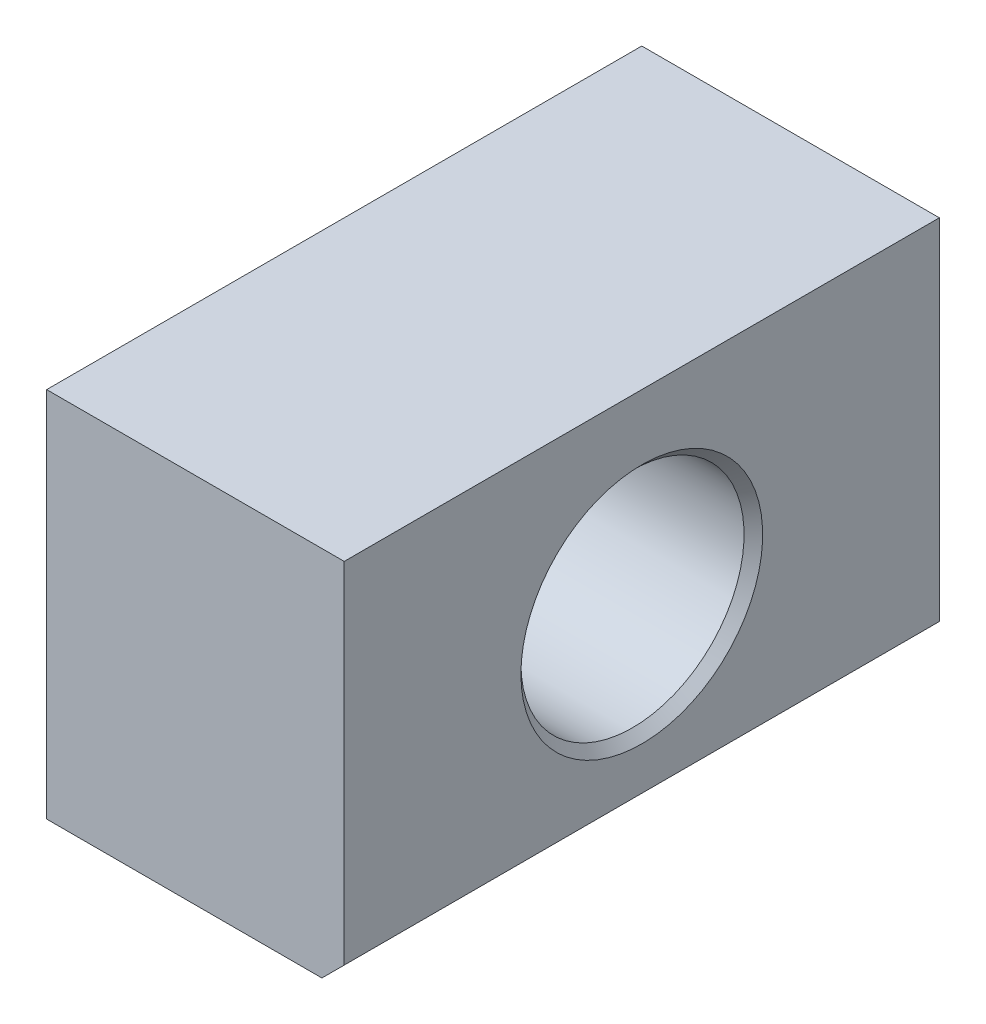
ISO-10303-21;
HEADER;
FILE_DESCRIPTION(('STEP AP214'),'2;1');
FILE_NAME('part.step','',(''),(''),'','','');
FILE_SCHEMA(('AUTOMOTIVE_DESIGN { 1 0 10303 214 1 1 1 1 }'));
ENDSEC;
DATA;
#1=APPLICATION_CONTEXT('core data for automotive mechanical design processes');
#2=APPLICATION_PROTOCOL_DEFINITION('international standard','automotive_design',2000,#1);
#3=PRODUCT_CONTEXT('',#1,'mechanical');
#4=PRODUCT('Part','Part','',(#3));
#5=PRODUCT_RELATED_PRODUCT_CATEGORY('part','',(#4));
#6=PRODUCT_DEFINITION_FORMATION('','',#4);
#7=PRODUCT_DEFINITION_CONTEXT('part definition',#1,'design');
#8=PRODUCT_DEFINITION('design','',#6,#7);
#9=PRODUCT_DEFINITION_SHAPE('','',#8);
#10=(LENGTH_UNIT() NAMED_UNIT(*) SI_UNIT(.MILLI.,.METRE.));
#11=(NAMED_UNIT(*) PLANE_ANGLE_UNIT() SI_UNIT($,.RADIAN.));
#12=(NAMED_UNIT(*) SI_UNIT($,.STERADIAN.) SOLID_ANGLE_UNIT());
#13=UNCERTAINTY_MEASURE_WITH_UNIT(LENGTH_MEASURE(1.E-05),#10,'distance_accuracy_value','');
#14=(GEOMETRIC_REPRESENTATION_CONTEXT(3) GLOBAL_UNCERTAINTY_ASSIGNED_CONTEXT((#13)) GLOBAL_UNIT_ASSIGNED_CONTEXT((#10,
#11,#12)) REPRESENTATION_CONTEXT('',''));
#15=CARTESIAN_POINT('',(0.,0.,0.));
#16=DIRECTION('',(0.,0.,1.));
#17=DIRECTION('',(1.,0.,0.));
#18=AXIS2_PLACEMENT_3D('',#15,#16,#17);
#19=CARTESIAN_POINT('',(-2.,-2.5,8.));
#20=DIRECTION('',(1.,0.,0.));
#21=DIRECTION('',(0.,0.,-1.));
#22=AXIS2_PLACEMENT_3D('',#19,#20,#21);
#23=PLANE('',#22);
#24=CARTESIAN_POINT('',(-2.,0.,4.));
#25=DIRECTION('',(-1.,0.,0.));
#26=DIRECTION('',(0.,0.,1.));
#27=AXIS2_PLACEMENT_3D('',#24,#25,#26);
#28=CIRCLE('',#27,1.625);
#29=CARTESIAN_POINT('',(-2.,0.,5.625));
#30=VERTEX_POINT('',#29);
#31=EDGE_CURVE('E121',#30,#30,#28,.T.);
#32=ORIENTED_EDGE('',*,*,#31,.F.);
#33=EDGE_LOOP('',(#32));
#34=FACE_BOUND('',#33,.T.);
#35=DIRECTION('',(0.,-1.,0.));
#36=VECTOR('',#35,1.);
#37=CARTESIAN_POINT('',(-2.,-2.5,0.));
#38=LINE('',#37,#36);
#39=CARTESIAN_POINT('',(-2.,2.5,0.));
#40=VERTEX_POINT('',#39);
#41=CARTESIAN_POINT('',(-2.,-2.5,0.));
#42=VERTEX_POINT('',#41);
#43=EDGE_CURVE('E95',#40,#42,#38,.T.);
#44=ORIENTED_EDGE('',*,*,#43,.T.);
#45=DIRECTION('',(0.,0.,-1.));
#46=VECTOR('',#45,1.);
#47=CARTESIAN_POINT('',(-2.,-2.5,8.));
#48=LINE('',#47,#46);
#49=CARTESIAN_POINT('',(-2.,-2.5,8.));
#50=VERTEX_POINT('',#49);
#51=EDGE_CURVE('E78',#50,#42,#48,.T.);
#52=ORIENTED_EDGE('',*,*,#51,.F.);
#53=DIRECTION('',(0.,-1.,0.));
#54=VECTOR('',#53,1.);
#55=CARTESIAN_POINT('',(-2.,-2.5,8.));
#56=LINE('',#55,#54);
#57=CARTESIAN_POINT('',(-2.,2.5,8.));
#58=VERTEX_POINT('',#57);
#59=EDGE_CURVE('E83',#58,#50,#56,.T.);
#60=ORIENTED_EDGE('',*,*,#59,.F.);
#61=DIRECTION('',(0.,0.,-1.));
#62=VECTOR('',#61,1.);
#63=CARTESIAN_POINT('',(-2.,2.5,8.));
#64=LINE('',#63,#62);
#65=EDGE_CURVE('E102',#58,#40,#64,.T.);
#66=ORIENTED_EDGE('',*,*,#65,.T.);
#67=EDGE_LOOP('',(#44,#52,#60,#66));
#68=FACE_BOUND('',#67,.T.);
#69=ADVANCED_FACE('F31',(#34,#68),#23,.F.);
#70=CARTESIAN_POINT('',(-2.,-2.5,8.));
#71=DIRECTION('',(0.,1.,0.));
#72=DIRECTION('',(0.,0.,1.));
#73=AXIS2_PLACEMENT_3D('',#70,#71,#72);
#74=PLANE('',#73);
#75=DIRECTION('',(1.,0.,0.));
#76=VECTOR('',#75,1.);
#77=CARTESIAN_POINT('',(-2.,-2.5,0.));
#78=LINE('',#77,#76);
#79=CARTESIAN_POINT('',(1.7,-2.5,0.));
#80=VERTEX_POINT('',#79);
#81=EDGE_CURVE('E110',#42,#80,#78,.T.);
#82=ORIENTED_EDGE('',*,*,#81,.T.);
#83=DIRECTION('',(0.,0.,1.));
#84=VECTOR('',#83,1.);
#85=CARTESIAN_POINT('',(1.7,-2.5,8.));
#86=LINE('',#85,#84);
#87=CARTESIAN_POINT('',(1.7,-2.5,8.));
#88=VERTEX_POINT('',#87);
#89=EDGE_CURVE('E39',#80,#88,#86,.T.);
#90=ORIENTED_EDGE('',*,*,#89,.T.);
#91=DIRECTION('',(1.,0.,0.));
#92=VECTOR('',#91,1.);
#93=CARTESIAN_POINT('',(-2.,-2.5,8.));
#94=LINE('',#93,#92);
#95=EDGE_CURVE('E74',#50,#88,#94,.T.);
#96=ORIENTED_EDGE('',*,*,#95,.F.);
#97=ORIENTED_EDGE('',*,*,#51,.T.);
#98=EDGE_LOOP('',(#82,#90,#96,#97));
#99=FACE_BOUND('',#98,.T.);
#100=ADVANCED_FACE('F76',(#99),#74,.F.);
#101=CARTESIAN_POINT('',(2.,-2.5,8.));
#102=DIRECTION('',(-1.,0.,0.));
#103=DIRECTION('',(0.,0.,1.));
#104=AXIS2_PLACEMENT_3D('',#101,#102,#103);
#105=PLANE('',#104);
#106=CARTESIAN_POINT('',(2.,0.,4.));
#107=DIRECTION('',(-1.,0.,0.));
#108=DIRECTION('',(0.,0.,1.));
#109=AXIS2_PLACEMENT_3D('',#106,#107,#108);
#110=CIRCLE('',#109,1.625);
#111=CARTESIAN_POINT('',(2.,0.,5.625));
#112=VERTEX_POINT('',#111);
#113=EDGE_CURVE('E124',#112,#112,#110,.T.);
#114=ORIENTED_EDGE('',*,*,#113,.T.);
#115=EDGE_LOOP('',(#114));
#116=FACE_BOUND('',#115,.T.);
#117=DIRECTION('',(0.,1.,0.));
#118=VECTOR('',#117,1.);
#119=CARTESIAN_POINT('',(2.,-2.5,8.));
#120=LINE('',#119,#118);
#121=CARTESIAN_POINT('',(2.,-2.2,8.));
#122=VERTEX_POINT('',#121);
#123=CARTESIAN_POINT('',(2.,2.5,8.));
#124=VERTEX_POINT('',#123);
#125=EDGE_CURVE('E82',#122,#124,#120,.T.);
#126=ORIENTED_EDGE('',*,*,#125,.F.);
#127=DIRECTION('',(0.,0.,-1.));
#128=VECTOR('',#127,1.);
#129=CARTESIAN_POINT('',(2.,-2.2,8.));
#130=LINE('',#129,#128);
#131=CARTESIAN_POINT('',(2.,-2.2,0.));
#132=VERTEX_POINT('',#131);
#133=EDGE_CURVE('E96',#122,#132,#130,.T.);
#134=ORIENTED_EDGE('',*,*,#133,.T.);
#135=DIRECTION('',(0.,1.,0.));
#136=VECTOR('',#135,1.);
#137=CARTESIAN_POINT('',(2.,-2.5,0.));
#138=LINE('',#137,#136);
#139=CARTESIAN_POINT('',(2.,2.5,0.));
#140=VERTEX_POINT('',#139);
#141=EDGE_CURVE('E108',#132,#140,#138,.T.);
#142=ORIENTED_EDGE('',*,*,#141,.T.);
#143=DIRECTION('',(0.,0.,-1.));
#144=VECTOR('',#143,1.);
#145=CARTESIAN_POINT('',(2.,2.5,8.));
#146=LINE('',#145,#144);
#147=EDGE_CURVE('E97',#124,#140,#146,.T.);
#148=ORIENTED_EDGE('',*,*,#147,.F.);
#149=EDGE_LOOP('',(#126,#134,#142,#148));
#150=FACE_BOUND('',#149,.T.);
#151=ADVANCED_FACE('F128',(#116,#150),#105,.F.);
#152=CARTESIAN_POINT('',(-2.,2.5,8.));
#153=DIRECTION('',(0.,-1.,0.));
#154=DIRECTION('',(0.,0.,-1.));
#155=AXIS2_PLACEMENT_3D('',#152,#153,#154);
#156=PLANE('',#155);
#157=DIRECTION('',(-1.,0.,0.));
#158=VECTOR('',#157,1.);
#159=CARTESIAN_POINT('',(-2.,2.5,0.));
#160=LINE('',#159,#158);
#161=EDGE_CURVE('E92',#140,#40,#160,.T.);
#162=ORIENTED_EDGE('',*,*,#161,.T.);
#163=ORIENTED_EDGE('',*,*,#65,.F.);
#164=DIRECTION('',(-1.,0.,0.));
#165=VECTOR('',#164,1.);
#166=CARTESIAN_POINT('',(-2.,2.5,8.));
#167=LINE('',#166,#165);
#168=EDGE_CURVE('E88',#124,#58,#167,.T.);
#169=ORIENTED_EDGE('',*,*,#168,.F.);
#170=ORIENTED_EDGE('',*,*,#147,.T.);
#171=EDGE_LOOP('',(#162,#163,#169,#170));
#172=FACE_BOUND('',#171,.T.);
#173=ADVANCED_FACE('F158',(#172),#156,.F.);
#174=CARTESIAN_POINT('',(-2.,2.5,8.));
#175=DIRECTION('',(0.,0.,-1.));
#176=DIRECTION('',(-1.,0.,0.));
#177=AXIS2_PLACEMENT_3D('',#174,#175,#176);
#178=PLANE('',#177);
#179=ORIENTED_EDGE('',*,*,#95,.T.);
#180=DIRECTION('',(-0.707106781186548,-0.707106781186548,0.));
#181=VECTOR('',#180,1.);
#182=CARTESIAN_POINT('',(2.,-2.2,8.));
#183=LINE('',#182,#181);
#184=EDGE_CURVE('E11',#88,#122,#183,.F.);
#185=ORIENTED_EDGE('',*,*,#184,.T.);
#186=ORIENTED_EDGE('',*,*,#125,.T.);
#187=ORIENTED_EDGE('',*,*,#168,.T.);
#188=ORIENTED_EDGE('',*,*,#59,.T.);
#189=EDGE_LOOP('',(#179,#185,#186,#187,#188));
#190=FACE_BOUND('',#189,.T.);
#191=ADVANCED_FACE('F86',(#190),#178,.F.);
#192=CARTESIAN_POINT('',(-2.,2.5,0.));
#193=DIRECTION('',(0.,0.,-1.));
#194=DIRECTION('',(-1.,0.,0.));
#195=AXIS2_PLACEMENT_3D('',#192,#193,#194);
#196=PLANE('',#195);
#197=ORIENTED_EDGE('',*,*,#141,.F.);
#198=DIRECTION('',(0.707106781186548,0.707106781186548,0.));
#199=VECTOR('',#198,1.);
#200=CARTESIAN_POINT('',(2.35,-1.85,0.));
#201=LINE('',#200,#199);
#202=EDGE_CURVE('E53',#132,#80,#201,.F.);
#203=ORIENTED_EDGE('',*,*,#202,.T.);
#204=ORIENTED_EDGE('',*,*,#81,.F.);
#205=ORIENTED_EDGE('',*,*,#43,.F.);
#206=ORIENTED_EDGE('',*,*,#161,.F.);
#207=EDGE_LOOP('',(#197,#203,#204,#205,#206));
#208=FACE_BOUND('',#207,.T.);
#209=ADVANCED_FACE('F135',(#208),#196,.T.);
#210=CARTESIAN_POINT('',(1.875,0.,4.));
#211=DIRECTION('',(1.,0.,0.));
#212=DIRECTION('',(0.,0.,-1.));
#213=AXIS2_PLACEMENT_3D('',#210,#211,#212);
#214=CONICAL_SURFACE('',#213,1.5,0.785398163397443);
#215=ORIENTED_EDGE('',*,*,#113,.F.);
#216=EDGE_LOOP('',(#215));
#217=FACE_BOUND('',#216,.T.);
#218=CARTESIAN_POINT('',(1.875,0.,4.));
#219=DIRECTION('',(-1.,0.,0.));
#220=DIRECTION('',(0.,0.,1.));
#221=AXIS2_PLACEMENT_3D('',#218,#219,#220);
#222=CIRCLE('',#221,1.5);
#223=CARTESIAN_POINT('',(1.875,0.,5.5));
#224=VERTEX_POINT('',#223);
#225=EDGE_CURVE('E113',#224,#224,#222,.T.);
#226=ORIENTED_EDGE('',*,*,#225,.T.);
#227=EDGE_LOOP('',(#226));
#228=FACE_BOUND('',#227,.T.);
#229=ADVANCED_FACE('F131',(#217,#228),#214,.F.);
#230=CARTESIAN_POINT('',(-2.,0.,4.));
#231=DIRECTION('',(-1.,0.,0.));
#232=DIRECTION('',(0.,0.,1.));
#233=AXIS2_PLACEMENT_3D('',#230,#231,#232);
#234=CYLINDRICAL_SURFACE('',#233,1.5);
#235=ORIENTED_EDGE('',*,*,#225,.F.);
#236=EDGE_LOOP('',(#235));
#237=FACE_BOUND('',#236,.T.);
#238=CARTESIAN_POINT('',(-1.875,0.,4.));
#239=DIRECTION('',(-1.,0.,0.));
#240=DIRECTION('',(0.,0.,1.));
#241=AXIS2_PLACEMENT_3D('',#238,#239,#240);
#242=CIRCLE('',#241,1.5);
#243=CARTESIAN_POINT('',(-1.875,0.,5.5));
#244=VERTEX_POINT('',#243);
#245=EDGE_CURVE('E118',#244,#244,#242,.T.);
#246=ORIENTED_EDGE('',*,*,#245,.T.);
#247=EDGE_LOOP('',(#246));
#248=FACE_BOUND('',#247,.T.);
#249=ADVANCED_FACE('F134',(#237,#248),#234,.F.);
#250=CARTESIAN_POINT('',(-2.,0.,4.));
#251=DIRECTION('',(-1.,0.,0.));
#252=DIRECTION('',(0.,0.,1.));
#253=AXIS2_PLACEMENT_3D('',#250,#251,#252);
#254=CONICAL_SURFACE('',#253,1.625,0.785398163397453);
#255=ORIENTED_EDGE('',*,*,#245,.F.);
#256=EDGE_LOOP('',(#255));
#257=FACE_BOUND('',#256,.T.);
#258=ORIENTED_EDGE('',*,*,#31,.T.);
#259=EDGE_LOOP('',(#258));
#260=FACE_BOUND('',#259,.T.);
#261=ADVANCED_FACE('F141',(#257,#260),#254,.F.);
#262=CARTESIAN_POINT('',(2.,-2.2,8.));
#263=DIRECTION('',(-0.707106781186548,0.707106781186548,0.));
#264=DIRECTION('',(-0.707106781186548,-0.707106781186548,0.));
#265=AXIS2_PLACEMENT_3D('',#262,#263,#264);
#266=PLANE('',#265);
#267=ORIENTED_EDGE('',*,*,#184,.F.);
#268=ORIENTED_EDGE('',*,*,#89,.F.);
#269=ORIENTED_EDGE('',*,*,#202,.F.);
#270=ORIENTED_EDGE('',*,*,#133,.F.);
#271=EDGE_LOOP('',(#267,#268,#269,#270));
#272=FACE_BOUND('',#271,.T.);
#273=ADVANCED_FACE('F33',(#272),#266,.F.);
#274=CLOSED_SHELL('',(#69,#100,#151,#173,#191,#209,#229,#249,#261,#273));
#275=MANIFOLD_SOLID_BREP('B2',#274);
#276=ADVANCED_BREP_SHAPE_REPRESENTATION('',(#18,#275),#14);
#277=SHAPE_DEFINITION_REPRESENTATION(#9,#276);
ENDSEC;
END-ISO-10303-21;
